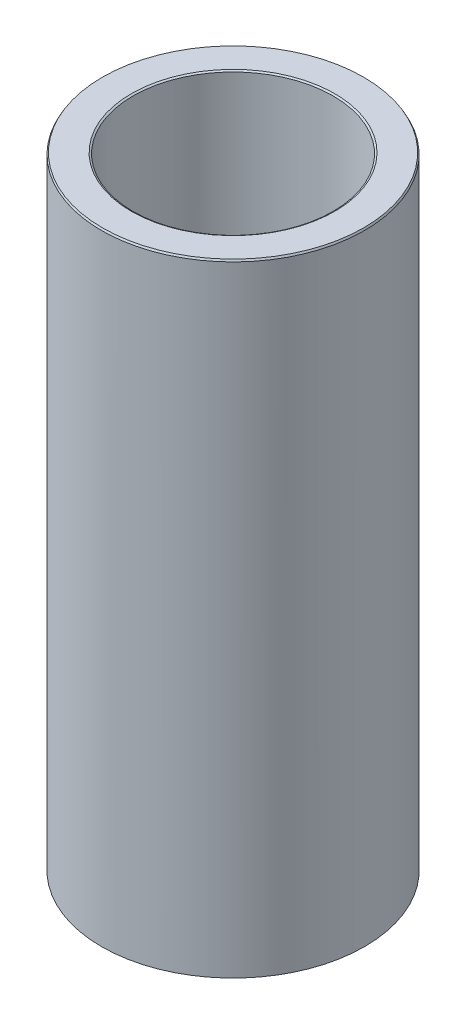
ISO-10303-21;
HEADER;
FILE_DESCRIPTION(('STEP AP214'),'2;1');
FILE_NAME('part.step','',(''),(''),'','','');
FILE_SCHEMA(('AUTOMOTIVE_DESIGN { 1 0 10303 214 1 1 1 1 }'));
ENDSEC;
DATA;
#1=APPLICATION_CONTEXT('core data for automotive mechanical design processes');
#2=APPLICATION_PROTOCOL_DEFINITION('international standard','automotive_design',2000,#1);
#3=PRODUCT_CONTEXT('',#1,'mechanical');
#4=PRODUCT('Part','Part','',(#3));
#5=PRODUCT_RELATED_PRODUCT_CATEGORY('part','',(#4));
#6=PRODUCT_DEFINITION_FORMATION('','',#4);
#7=PRODUCT_DEFINITION_CONTEXT('part definition',#1,'design');
#8=PRODUCT_DEFINITION('design','',#6,#7);
#9=PRODUCT_DEFINITION_SHAPE('','',#8);
#10=(LENGTH_UNIT() NAMED_UNIT(*) SI_UNIT(.MILLI.,.METRE.));
#11=(NAMED_UNIT(*) PLANE_ANGLE_UNIT() SI_UNIT($,.RADIAN.));
#12=(NAMED_UNIT(*) SI_UNIT($,.STERADIAN.) SOLID_ANGLE_UNIT());
#13=UNCERTAINTY_MEASURE_WITH_UNIT(LENGTH_MEASURE(1.E-05),#10,'distance_accuracy_value','');
#14=(GEOMETRIC_REPRESENTATION_CONTEXT(3) GLOBAL_UNCERTAINTY_ASSIGNED_CONTEXT((#13)) GLOBAL_UNIT_ASSIGNED_CONTEXT((#10,
#11,#12)) REPRESENTATION_CONTEXT('',''));
#15=CARTESIAN_POINT('',(0.,0.,0.));
#16=DIRECTION('',(0.,0.,1.));
#17=DIRECTION('',(1.,0.,0.));
#18=AXIS2_PLACEMENT_3D('',#15,#16,#17);
#19=CARTESIAN_POINT('',(0.,118.364992379509,0.));
#20=DIRECTION('',(0.,-1.,0.));
#21=DIRECTION('',(0.,0.,-1.));
#22=AXIS2_PLACEMENT_3D('',#19,#20,#21);
#23=CYLINDRICAL_SURFACE('',#22,25.);
#24=CARTESIAN_POINT('',(0.,0.192509478858904,0.));
#25=DIRECTION('',(0.,1.,0.));
#26=DIRECTION('',(0.,0.,1.));
#27=AXIS2_PLACEMENT_3D('',#24,#25,#26);
#28=CIRCLE('',#27,25.);
#29=CARTESIAN_POINT('',(0.,0.192509478858904,-25.));
#30=VERTEX_POINT('',#29);
#31=EDGE_CURVE('E10',#30,#30,#28,.T.);
#32=CARTESIAN_POINT('',(0.,118.031556181187,0.));
#33=DIRECTION('',(0.,1.,0.));
#34=DIRECTION('',(0.,0.,1.));
#35=AXIS2_PLACEMENT_3D('',#32,#33,#34);
#36=CIRCLE('',#35,25.);
#37=CARTESIAN_POINT('',(0.,118.031556181187,-25.));
#38=VERTEX_POINT('',#37);
#39=EDGE_CURVE('E50',#38,#38,#36,.F.);
#40=CARTESIAN_POINT('',(0.,0.192509478858904,-25.));
#41=CARTESIAN_POINT('',(0.,1.41999954867482,-25.));
#42=CARTESIAN_POINT('',(0.,2.64748961849073,-25.));
#43=CARTESIAN_POINT('',(0.,5.10246975812256,-25.));
#44=CARTESIAN_POINT('',(0.,6.32995982793848,-25.));
#45=CARTESIAN_POINT('',(0.,8.78493996757031,-25.));
#46=CARTESIAN_POINT('',(0.,10.0124300373862,-25.));
#47=CARTESIAN_POINT('',(0.,12.4674101770181,-25.));
#48=CARTESIAN_POINT('',(0.,13.694900246834,-25.));
#49=CARTESIAN_POINT('',(0.,16.1498803864658,-25.));
#50=CARTESIAN_POINT('',(0.,17.3773704562817,-25.));
#51=CARTESIAN_POINT('',(0.,19.8323505959135,-25.));
#52=CARTESIAN_POINT('',(0.,21.0598406657295,-25.));
#53=CARTESIAN_POINT('',(0.,23.5148208053613,-25.));
#54=CARTESIAN_POINT('',(0.,24.7423108751772,-25.));
#55=CARTESIAN_POINT('',(0.,27.197291014809,-25.));
#56=CARTESIAN_POINT('',(0.,28.4247810846249,-25.));
#57=CARTESIAN_POINT('',(0.,30.8797612242568,-25.));
#58=CARTESIAN_POINT('',(0.,32.1072512940727,-25.));
#59=CARTESIAN_POINT('',(0.,34.5622314337045,-25.));
#60=CARTESIAN_POINT('',(0.,35.7897215035204,-25.));
#61=CARTESIAN_POINT('',(0.,38.2447016431523,-25.));
#62=CARTESIAN_POINT('',(0.,39.4721917129682,-25.));
#63=CARTESIAN_POINT('',(0.,41.9271718526,-25.));
#64=CARTESIAN_POINT('',(0.,43.1546619224159,-25.));
#65=CARTESIAN_POINT('',(0.,45.6096420620477,-25.));
#66=CARTESIAN_POINT('',(0.,46.8371321318637,-25.));
#67=CARTESIAN_POINT('',(0.,49.2921122714955,-25.));
#68=CARTESIAN_POINT('',(0.,50.5196023413114,-25.));
#69=CARTESIAN_POINT('',(0.,52.9745824809432,-25.));
#70=CARTESIAN_POINT('',(0.,54.2020725507591,-25.));
#71=CARTESIAN_POINT('',(0.,56.657052690391,-25.));
#72=CARTESIAN_POINT('',(0.,57.8845427602069,-25.));
#73=CARTESIAN_POINT('',(0.,60.3395228998387,-25.));
#74=CARTESIAN_POINT('',(0.,61.5670129696546,-25.));
#75=CARTESIAN_POINT('',(0.,64.0219931092865,-25.));
#76=CARTESIAN_POINT('',(0.,65.2494831791024,-25.));
#77=CARTESIAN_POINT('',(0.,67.7044633187342,-25.));
#78=CARTESIAN_POINT('',(0.,68.9319533885501,-25.));
#79=CARTESIAN_POINT('',(0.,71.3869335281819,-25.));
#80=CARTESIAN_POINT('',(0.,72.6144235979979,-25.));
#81=CARTESIAN_POINT('',(0.,75.0694037376297,-25.));
#82=CARTESIAN_POINT('',(0.,76.2968938074456,-25.));
#83=CARTESIAN_POINT('',(0.,78.7518739470774,-25.));
#84=CARTESIAN_POINT('',(0.,79.9793640168934,-25.));
#85=CARTESIAN_POINT('',(0.,82.4343441565252,-25.));
#86=CARTESIAN_POINT('',(0.,83.6618342263411,-25.));
#87=CARTESIAN_POINT('',(0.,86.1168143659729,-25.));
#88=CARTESIAN_POINT('',(0.,87.3443044357888,-25.));
#89=CARTESIAN_POINT('',(0.,89.7992845754207,-25.));
#90=CARTESIAN_POINT('',(0.,91.0267746452366,-25.));
#91=CARTESIAN_POINT('',(0.,93.4817547848684,-25.));
#92=CARTESIAN_POINT('',(0.,94.7092448546843,-25.));
#93=CARTESIAN_POINT('',(0.,97.1642249943162,-25.));
#94=CARTESIAN_POINT('',(0.,98.3917150641321,-25.));
#95=CARTESIAN_POINT('',(0.,100.846695203764,-25.));
#96=CARTESIAN_POINT('',(0.,102.07418527358,-25.));
#97=CARTESIAN_POINT('',(0.,104.529165413212,-25.));
#98=CARTESIAN_POINT('',(0.,105.756655483028,-25.));
#99=CARTESIAN_POINT('',(0.,108.211635622659,-25.));
#100=CARTESIAN_POINT('',(0.,109.439125692475,-25.));
#101=CARTESIAN_POINT('',(0.,111.894105832107,-25.));
#102=CARTESIAN_POINT('',(0.,113.121595901923,-25.));
#103=CARTESIAN_POINT('',(0.,115.576576041555,-25.));
#104=CARTESIAN_POINT('',(0.,116.804066111371,-25.));
#105=CARTESIAN_POINT('',(0.,118.031556181187,-25.));
#106=B_SPLINE_CURVE_WITH_KNOTS('',3,(#40,#41,#42,#43,#44,#45,#46,#47,#48,#49,#50,#51,#52,#53,
#54,#55,#56,#57,#58,#59,#60,#61,#62,#63,#64,#65,#66,#67,#68,#69,#70,#71,#72,#73,#74,#75,#76,#77,
#78,#79,#80,#81,#82,#83,#84,#85,#86,#87,#88,#89,#90,#91,#92,#93,#94,#95,#96,#97,#98,#99,#100,
#101,#102,#103,#104,#105),.UNSPECIFIED.,.F.,.F.,(4,2,2,2,2,2,2,2,2,2,2,2,2,2,2,2,2,2,2,2,2,2,2,
2,2,2,2,2,2,2,2,2,4),(0.,3.68247020944774,7.36494041889549,11.0474106283432,14.729880837791,
18.4123510472387,22.0948212566865,25.7772914661342,29.459761675582,33.1422318850297,
36.8247020944774,40.5071723039252,44.1896425133729,47.8721127228207,51.5545829322684,
55.2370531417162,58.9195233511639,62.6019935606116,66.2844637700594,69.9669339795071,
73.6494041889549,77.3318743984026,81.0143446078504,84.6968148172981,88.3792850267458,
92.0617552361936,95.7442254456413,99.4266956550891,103.109165864537,106.791636073985,
110.474106283432,114.15657649288,117.839046702328),.UNSPECIFIED.);
#107=EDGE_CURVE('BSEAM39',#30,#38,#106,.T.);
#108=ORIENTED_EDGE('',*,*,#31,.T.);
#109=ORIENTED_EDGE('',*,*,#39,.T.);
#110=ORIENTED_EDGE('',*,*,#107,.T.);
#111=ORIENTED_EDGE('',*,*,#107,.F.);
#112=EDGE_LOOP('',(#108,#110,#109,#111));
#113=FACE_BOUND('',#112,.T.);
#114=ADVANCED_FACE('F39',(#113),#23,.T.);
#115=CARTESIAN_POINT('',(0.,118.364992379509,0.));
#116=DIRECTION('',(0.,1.,0.));
#117=DIRECTION('',(0.,0.,1.));
#118=AXIS2_PLACEMENT_3D('',#115,#116,#117);
#119=PLANE('',#118);
#120=CARTESIAN_POINT('',(0.,118.364992379509,0.));
#121=DIRECTION('',(0.,1.,0.));
#122=DIRECTION('',(0.,0.,1.));
#123=AXIS2_PLACEMENT_3D('',#120,#121,#122);
#124=CIRCLE('',#123,19.3455309401485);
#125=CARTESIAN_POINT('',(0.,118.364992379509,19.3455309401485));
#126=VERTEX_POINT('',#125);
#127=EDGE_CURVE('E58',#126,#126,#124,.F.);
#128=ORIENTED_EDGE('',*,*,#127,.T.);
#129=EDGE_LOOP('',(#128));
#130=FACE_BOUND('',#129,.T.);
#131=CARTESIAN_POINT('',(0.,118.364992379509,0.));
#132=DIRECTION('',(0.,1.,0.));
#133=DIRECTION('',(0.,0.,1.));
#134=AXIS2_PLACEMENT_3D('',#131,#132,#133);
#135=CIRCLE('',#134,24.8074905211412);
#136=CARTESIAN_POINT('',(0.,118.364992379509,24.8074905211412));
#137=VERTEX_POINT('',#136);
#138=EDGE_CURVE('E61',#137,#137,#135,.T.);
#139=ORIENTED_EDGE('',*,*,#138,.T.);
#140=EDGE_LOOP('',(#139));
#141=FACE_BOUND('',#140,.T.);
#142=ADVANCED_FACE('F88',(#130,#141),#119,.T.);
#143=CARTESIAN_POINT('',(0.,0.,0.));
#144=DIRECTION('',(0.,1.,0.));
#145=DIRECTION('',(0.,0.,1.));
#146=AXIS2_PLACEMENT_3D('',#143,#144,#145);
#147=PLANE('',#146);
#148=CARTESIAN_POINT('',(0.,0.,0.));
#149=DIRECTION('',(0.,1.,0.));
#150=DIRECTION('',(0.,0.,1.));
#151=AXIS2_PLACEMENT_3D('',#148,#149,#150);
#152=CIRCLE('',#151,19.2046042206851);
#153=CARTESIAN_POINT('',(0.,0.,19.2046042206851));
#154=VERTEX_POINT('',#153);
#155=EDGE_CURVE('E51',#154,#154,#152,.T.);
#156=ORIENTED_EDGE('',*,*,#155,.T.);
#157=EDGE_LOOP('',(#156));
#158=FACE_BOUND('',#157,.T.);
#159=CARTESIAN_POINT('',(0.,0.,0.));
#160=DIRECTION('',(0.,1.,0.));
#161=DIRECTION('',(0.,0.,1.));
#162=AXIS2_PLACEMENT_3D('',#159,#160,#161);
#163=CIRCLE('',#162,24.6665638016778);
#164=CARTESIAN_POINT('',(0.,0.,24.6665638016778));
#165=VERTEX_POINT('',#164);
#166=EDGE_CURVE('E54',#165,#165,#163,.F.);
#167=ORIENTED_EDGE('',*,*,#166,.T.);
#168=EDGE_LOOP('',(#167));
#169=FACE_BOUND('',#168,.T.);
#170=ADVANCED_FACE('F83',(#158,#169),#147,.F.);
#171=CARTESIAN_POINT('',(0.,118.364992379509,0.));
#172=DIRECTION('',(0.,-1.,0.));
#173=DIRECTION('',(0.,0.,-1.));
#174=AXIS2_PLACEMENT_3D('',#171,#172,#173);
#175=CYLINDRICAL_SURFACE('',#174,19.0120947418263);
#176=CARTESIAN_POINT('',(0.,118.17248290065,0.));
#177=DIRECTION('',(0.,1.,0.));
#178=DIRECTION('',(0.,0.,1.));
#179=AXIS2_PLACEMENT_3D('',#176,#177,#178);
#180=CIRCLE('',#179,19.0120947418263);
#181=CARTESIAN_POINT('',(0.,118.17248290065,-19.0120947418263));
#182=VERTEX_POINT('',#181);
#183=EDGE_CURVE('E67',#182,#182,#180,.T.);
#184=CARTESIAN_POINT('',(0.,0.333436198322157,0.));
#185=DIRECTION('',(0.,1.,0.));
#186=DIRECTION('',(0.,0.,1.));
#187=AXIS2_PLACEMENT_3D('',#184,#185,#186);
#188=CIRCLE('',#187,19.0120947418263);
#189=CARTESIAN_POINT('',(0.,0.333436198322157,-19.0120947418263));
#190=VERTEX_POINT('',#189);
#191=EDGE_CURVE('E69',#190,#190,#188,.F.);
#192=CARTESIAN_POINT('',(0.,118.17248290065,-19.0120947418263));
#193=CARTESIAN_POINT('',(0.,116.944992830834,-19.0120947418263));
#194=CARTESIAN_POINT('',(0.,115.717502761018,-19.0120947418263));
#195=CARTESIAN_POINT('',(0.,113.262522621386,-19.0120947418263));
#196=CARTESIAN_POINT('',(0.,112.03503255157,-19.0120947418263));
#197=CARTESIAN_POINT('',(0.,109.580052411938,-19.0120947418263));
#198=CARTESIAN_POINT('',(0.,108.352562342123,-19.0120947418263));
#199=CARTESIAN_POINT('',(0.,105.897582202491,-19.0120947418263));
#200=CARTESIAN_POINT('',(0.,104.670092132675,-19.0120947418263));
#201=CARTESIAN_POINT('',(0.,102.215111993043,-19.0120947418263));
#202=CARTESIAN_POINT('',(0.,100.987621923227,-19.0120947418263));
#203=CARTESIAN_POINT('',(0.,98.5326417835953,-19.0120947418263));
#204=CARTESIAN_POINT('',(0.,97.3051517137794,-19.0120947418263));
#205=CARTESIAN_POINT('',(0.,94.8501715741475,-19.0120947418263));
#206=CARTESIAN_POINT('',(0.,93.6226815043316,-19.0120947418263));
#207=CARTESIAN_POINT('',(0.,91.1677013646998,-19.0120947418263));
#208=CARTESIAN_POINT('',(0.,89.9402112948839,-19.0120947418263));
#209=CARTESIAN_POINT('',(0.,87.485231155252,-19.0120947418263));
#210=CARTESIAN_POINT('',(0.,86.2577410854361,-19.0120947418263));
#211=CARTESIAN_POINT('',(0.,83.8027609458043,-19.0120947418263));
#212=CARTESIAN_POINT('',(0.,82.5752708759884,-19.0120947418263));
#213=CARTESIAN_POINT('',(0.,80.1202907363566,-19.0120947418263));
#214=CARTESIAN_POINT('',(0.,78.8928006665406,-19.0120947418263));
#215=CARTESIAN_POINT('',(0.,76.4378205269088,-19.0120947418263));
#216=CARTESIAN_POINT('',(0.,75.2103304570929,-19.0120947418263));
#217=CARTESIAN_POINT('',(0.,72.7553503174611,-19.0120947418263));
#218=CARTESIAN_POINT('',(0.,71.5278602476452,-19.0120947418263));
#219=CARTESIAN_POINT('',(0.,69.0728801080133,-19.0120947418263));
#220=CARTESIAN_POINT('',(0.,67.8453900381974,-19.0120947418263));
#221=CARTESIAN_POINT('',(0.,65.3904098985656,-19.0120947418263));
#222=CARTESIAN_POINT('',(0.,64.1629198287497,-19.0120947418263));
#223=CARTESIAN_POINT('',(0.,61.7079396891179,-19.0120947418263));
#224=CARTESIAN_POINT('',(0.,60.4804496193019,-19.0120947418263));
#225=CARTESIAN_POINT('',(0.,58.0254694796701,-19.0120947418263));
#226=CARTESIAN_POINT('',(0.,56.7979794098542,-19.0120947418263));
#227=CARTESIAN_POINT('',(0.,54.3429992702224,-19.0120947418263));
#228=CARTESIAN_POINT('',(0.,53.1155092004064,-19.0120947418263));
#229=CARTESIAN_POINT('',(0.,50.6605290607746,-19.0120947418263));
#230=CARTESIAN_POINT('',(0.,49.4330389909587,-19.0120947418263));
#231=CARTESIAN_POINT('',(0.,46.9780588513269,-19.0120947418263));
#232=CARTESIAN_POINT('',(0.,45.750568781511,-19.0120947418263));
#233=CARTESIAN_POINT('',(0.,43.2955886418791,-19.0120947418263));
#234=CARTESIAN_POINT('',(0.,42.0680985720632,-19.0120947418263));
#235=CARTESIAN_POINT('',(0.,39.6131184324314,-19.0120947418263));
#236=CARTESIAN_POINT('',(0.,38.3856283626155,-19.0120947418263));
#237=CARTESIAN_POINT('',(0.,35.9306482229837,-19.0120947418263));
#238=CARTESIAN_POINT('',(0.,34.7031581531677,-19.0120947418263));
#239=CARTESIAN_POINT('',(0.,32.2481780135359,-19.0120947418263));
#240=CARTESIAN_POINT('',(0.,31.02068794372,-19.0120947418263));
#241=CARTESIAN_POINT('',(0.,28.5657078040882,-19.0120947418263));
#242=CARTESIAN_POINT('',(0.,27.3382177342723,-19.0120947418263));
#243=CARTESIAN_POINT('',(0.,24.8832375946404,-19.0120947418263));
#244=CARTESIAN_POINT('',(0.,23.6557475248245,-19.0120947418263));
#245=CARTESIAN_POINT('',(0.,21.2007673851927,-19.0120947418263));
#246=CARTESIAN_POINT('',(0.,19.9732773153768,-19.0120947418263));
#247=CARTESIAN_POINT('',(0.,17.5182971757449,-19.0120947418263));
#248=CARTESIAN_POINT('',(0.,16.290807105929,-19.0120947418263));
#249=CARTESIAN_POINT('',(0.,13.8358269662972,-19.0120947418263));
#250=CARTESIAN_POINT('',(0.,12.6083368964813,-19.0120947418263));
#251=CARTESIAN_POINT('',(0.,10.1533567568495,-19.0120947418263));
#252=CARTESIAN_POINT('',(0.,8.92586668703355,-19.0120947418263));
#253=CARTESIAN_POINT('',(0.,6.47088654740173,-19.0120947418263));
#254=CARTESIAN_POINT('',(0.,5.24339647758582,-19.0120947418263));
#255=CARTESIAN_POINT('',(0.,2.78841633795399,-19.0120947418263));
#256=CARTESIAN_POINT('',(0.,1.56092626813807,-19.0120947418263));
#257=CARTESIAN_POINT('',(0.,0.333436198322157,-19.0120947418263));
#258=B_SPLINE_CURVE_WITH_KNOTS('',3,(#192,#193,#194,#195,#196,#197,#198,#199,#200,#201,#202,
#203,#204,#205,#206,#207,#208,#209,#210,#211,#212,#213,#214,#215,#216,#217,#218,#219,#220,#221,
#222,#223,#224,#225,#226,#227,#228,#229,#230,#231,#232,#233,#234,#235,#236,#237,#238,#239,#240,
#241,#242,#243,#244,#245,#246,#247,#248,#249,#250,#251,#252,#253,#254,#255,#256,#257),
.UNSPECIFIED.,.F.,.F.,(4,2,2,2,2,2,2,2,2,2,2,2,2,2,2,2,2,2,2,2,2,2,2,2,2,2,2,2,2,2,2,2,4),(0.,
3.68247020944773,7.36494041889547,11.0474106283432,14.729880837791,18.4123510472387,
22.0948212566864,25.7772914661342,29.4597616755819,33.1422318850297,36.8247020944774,
40.5071723039251,44.1896425133729,47.8721127228206,51.5545829322684,55.2370531417161,
58.9195233511638,62.6019935606116,66.2844637700593,69.9669339795071,73.6494041889548,
77.3318743984026,81.0143446078503,84.696814817298,88.3792850267458,92.0617552361935,
95.7442254456413,99.426695655089,103.109165864537,106.791636073984,110.474106283432,
114.15657649288,117.839046702328),.UNSPECIFIED.);
#259=EDGE_CURVE('BSEAM71',#182,#190,#258,.T.);
#260=ORIENTED_EDGE('',*,*,#183,.T.);
#261=ORIENTED_EDGE('',*,*,#191,.T.);
#262=ORIENTED_EDGE('',*,*,#259,.T.);
#263=ORIENTED_EDGE('',*,*,#259,.F.);
#264=EDGE_LOOP('',(#260,#262,#261,#263));
#265=FACE_BOUND('',#264,.T.);
#266=ADVANCED_FACE('F71',(#265),#175,.F.);
#267=CARTESIAN_POINT('',(0.,118.17248290065,0.));
#268=DIRECTION('',(0.,1.,0.));
#269=DIRECTION('',(0.,0.,1.));
#270=AXIS2_PLACEMENT_3D('',#267,#268,#269);
#271=CONICAL_SURFACE('',#270,19.0120947418263,1.04719755119656);
#272=ORIENTED_EDGE('',*,*,#127,.F.);
#273=EDGE_LOOP('',(#272));
#274=FACE_BOUND('',#273,.T.);
#275=ORIENTED_EDGE('',*,*,#183,.F.);
#276=EDGE_LOOP('',(#275));
#277=FACE_BOUND('',#276,.T.);
#278=ADVANCED_FACE('F77',(#274,#277),#271,.F.);
#279=CARTESIAN_POINT('',(0.,0.,0.));
#280=DIRECTION('',(0.,-1.,0.));
#281=DIRECTION('',(0.,0.,-1.));
#282=AXIS2_PLACEMENT_3D('',#279,#280,#281);
#283=CONICAL_SURFACE('',#282,19.2046042206851,0.523598775598291);
#284=ORIENTED_EDGE('',*,*,#191,.F.);
#285=EDGE_LOOP('',(#284));
#286=FACE_BOUND('',#285,.T.);
#287=ORIENTED_EDGE('',*,*,#155,.F.);
#288=EDGE_LOOP('',(#287));
#289=FACE_BOUND('',#288,.T.);
#290=ADVANCED_FACE('F73',(#286,#289),#283,.F.);
#291=CARTESIAN_POINT('',(0.,0.192509478858904,0.));
#292=DIRECTION('',(0.,1.,0.));
#293=DIRECTION('',(0.,0.,1.));
#294=AXIS2_PLACEMENT_3D('',#291,#292,#293);
#295=CONICAL_SURFACE('',#294,25.,1.04719755119661);
#296=ORIENTED_EDGE('',*,*,#166,.F.);
#297=EDGE_LOOP('',(#296));
#298=FACE_BOUND('',#297,.T.);
#299=ORIENTED_EDGE('',*,*,#31,.F.);
#300=EDGE_LOOP('',(#299));
#301=FACE_BOUND('',#300,.T.);
#302=ADVANCED_FACE('F76',(#298,#301),#295,.T.);
#303=CARTESIAN_POINT('',(0.,118.364992379509,0.));
#304=DIRECTION('',(0.,-1.,0.));
#305=DIRECTION('',(0.,0.,-1.));
#306=AXIS2_PLACEMENT_3D('',#303,#304,#305);
#307=CONICAL_SURFACE('',#306,24.8074905211412,0.523598775598301);
#308=ORIENTED_EDGE('',*,*,#39,.F.);
#309=EDGE_LOOP('',(#308));
#310=FACE_BOUND('',#309,.T.);
#311=ORIENTED_EDGE('',*,*,#138,.F.);
#312=EDGE_LOOP('',(#311));
#313=FACE_BOUND('',#312,.T.);
#314=ADVANCED_FACE('F45',(#310,#313),#307,.T.);
#315=CLOSED_SHELL('',(#114,#142,#170,#266,#278,#290,#302,#314));
#316=MANIFOLD_SOLID_BREP('B2',#315);
#317=ADVANCED_BREP_SHAPE_REPRESENTATION('',(#18,#316),#14);
#318=SHAPE_DEFINITION_REPRESENTATION(#9,#317);
ENDSEC;
END-ISO-10303-21;
